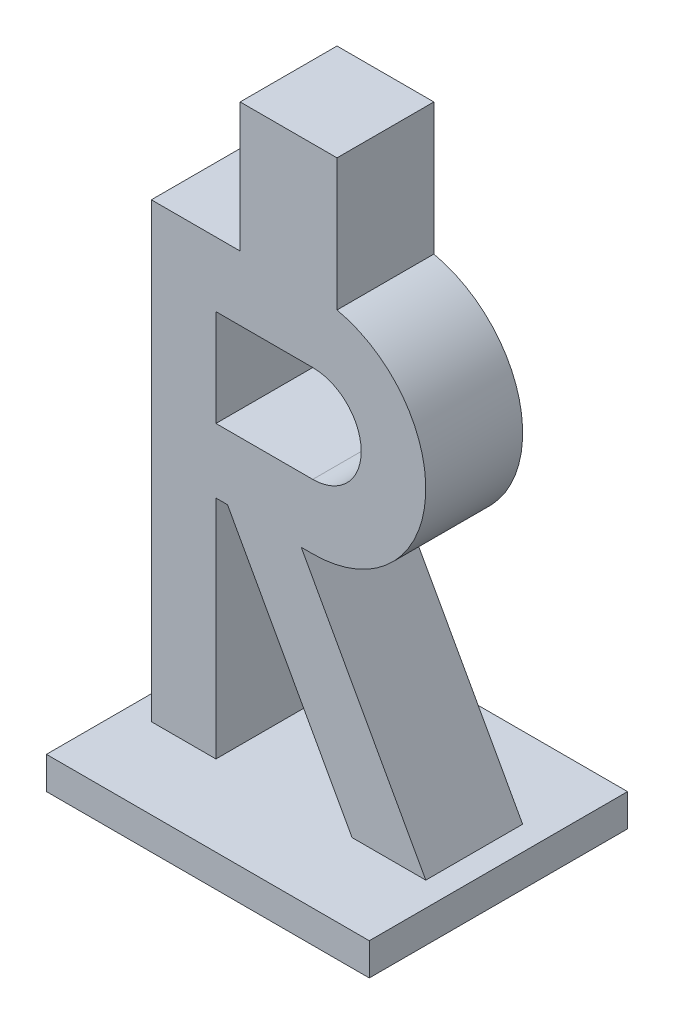
ISO-10303-21;
HEADER;
FILE_DESCRIPTION(('STEP AP214'),'2;1');
FILE_NAME('part.step','',(''),(''),'','','');
FILE_SCHEMA(('AUTOMOTIVE_DESIGN { 1 0 10303 214 1 1 1 1 }'));
ENDSEC;
DATA;
#1=APPLICATION_CONTEXT('core data for automotive mechanical design processes');
#2=APPLICATION_PROTOCOL_DEFINITION('international standard','automotive_design',2000,#1);
#3=PRODUCT_CONTEXT('',#1,'mechanical');
#4=PRODUCT('Part','Part','',(#3));
#5=PRODUCT_RELATED_PRODUCT_CATEGORY('part','',(#4));
#6=PRODUCT_DEFINITION_FORMATION('','',#4);
#7=PRODUCT_DEFINITION_CONTEXT('part definition',#1,'design');
#8=PRODUCT_DEFINITION('design','',#6,#7);
#9=PRODUCT_DEFINITION_SHAPE('','',#8);
#10=(LENGTH_UNIT() NAMED_UNIT(*) SI_UNIT(.MILLI.,.METRE.));
#11=(NAMED_UNIT(*) PLANE_ANGLE_UNIT() SI_UNIT($,.RADIAN.));
#12=(NAMED_UNIT(*) SI_UNIT($,.STERADIAN.) SOLID_ANGLE_UNIT());
#13=UNCERTAINTY_MEASURE_WITH_UNIT(LENGTH_MEASURE(1.E-05),#10,'distance_accuracy_value','');
#14=(GEOMETRIC_REPRESENTATION_CONTEXT(3) GLOBAL_UNCERTAINTY_ASSIGNED_CONTEXT((#13)) GLOBAL_UNIT_ASSIGNED_CONTEXT((#10,
#11,#12)) REPRESENTATION_CONTEXT('',''));
#15=CARTESIAN_POINT('',(0.,0.,0.));
#16=DIRECTION('',(0.,0.,1.));
#17=DIRECTION('',(1.,0.,0.));
#18=AXIS2_PLACEMENT_3D('',#15,#16,#17);
#19=CARTESIAN_POINT('',(25.,52.5,15.));
#20=DIRECTION('',(0.,0.,-1.));
#21=DIRECTION('',(-1.,0.,0.));
#22=AXIS2_PLACEMENT_3D('',#19,#20,#21);
#23=PLANE('',#22);
#24=CARTESIAN_POINT('',(25.,52.5,15.));
#25=DIRECTION('',(0.,0.,1.));
#26=DIRECTION('',(-1.,0.,0.));
#27=AXIS2_PLACEMENT_3D('',#24,#25,#26);
#28=CIRCLE('',#27,17.5);
#29=CARTESIAN_POINT('',(25.,35.,15.));
#30=VERTEX_POINT('',#29);
#31=CARTESIAN_POINT('',(28.75,69.5934929139717,15.));
#32=VERTEX_POINT('',#31);
#33=EDGE_CURVE('E292',#30,#32,#28,.T.);
#34=ORIENTED_EDGE('',*,*,#33,.T.);
#35=DIRECTION('',(0.,1.,0.));
#36=VECTOR('',#35,1.);
#37=CARTESIAN_POINT('',(28.75,69.5934929139717,15.));
#38=LINE('',#37,#36);
#39=CARTESIAN_POINT('',(28.75,90.,15.));
#40=VERTEX_POINT('',#39);
#41=EDGE_CURVE('E209',#32,#40,#38,.T.);
#42=ORIENTED_EDGE('',*,*,#41,.T.);
#43=DIRECTION('',(-1.,0.,0.));
#44=VECTOR('',#43,1.);
#45=CARTESIAN_POINT('',(28.75,90.,15.));
#46=LINE('',#45,#44);
#47=CARTESIAN_POINT('',(13.75,90.,15.));
#48=VERTEX_POINT('',#47);
#49=EDGE_CURVE('E185',#40,#48,#46,.T.);
#50=ORIENTED_EDGE('',*,*,#49,.T.);
#51=DIRECTION('',(0.,-1.,0.));
#52=VECTOR('',#51,1.);
#53=CARTESIAN_POINT('',(13.75,69.5934929139717,15.));
#54=LINE('',#53,#52);
#55=CARTESIAN_POINT('',(13.75,70.,15.));
#56=VERTEX_POINT('',#55);
#57=EDGE_CURVE('E52',#48,#56,#54,.T.);
#58=ORIENTED_EDGE('',*,*,#57,.T.);
#59=DIRECTION('',(-1.,0.,0.));
#60=VECTOR('',#59,1.);
#61=CARTESIAN_POINT('',(0.,70.,15.));
#62=LINE('',#61,#60);
#63=CARTESIAN_POINT('',(0.,70.,15.));
#64=VERTEX_POINT('',#63);
#65=EDGE_CURVE('E295',#56,#64,#62,.T.);
#66=ORIENTED_EDGE('',*,*,#65,.T.);
#67=DIRECTION('',(0.,-1.,0.));
#68=VECTOR('',#67,1.);
#69=CARTESIAN_POINT('',(0.,0.,15.));
#70=LINE('',#69,#68);
#71=CARTESIAN_POINT('',(0.,0.,15.));
#72=VERTEX_POINT('',#71);
#73=EDGE_CURVE('E297',#64,#72,#70,.T.);
#74=ORIENTED_EDGE('',*,*,#73,.T.);
#75=DIRECTION('',(1.,0.,0.));
#76=VECTOR('',#75,1.);
#77=CARTESIAN_POINT('',(10.,0.,15.));
#78=LINE('',#77,#76);
#79=CARTESIAN_POINT('',(10.,0.,15.));
#80=VERTEX_POINT('',#79);
#81=EDGE_CURVE('E274',#72,#80,#78,.T.);
#82=ORIENTED_EDGE('',*,*,#81,.T.);
#83=DIRECTION('',(0.,1.,0.));
#84=VECTOR('',#83,1.);
#85=CARTESIAN_POINT('',(10.,35.,15.));
#86=LINE('',#85,#84);
#87=CARTESIAN_POINT('',(10.,35.,15.));
#88=VERTEX_POINT('',#87);
#89=EDGE_CURVE('E277',#80,#88,#86,.T.);
#90=ORIENTED_EDGE('',*,*,#89,.T.);
#91=DIRECTION('',(1.,0.,0.));
#92=VECTOR('',#91,1.);
#93=CARTESIAN_POINT('',(11.7908306023726,35.,15.));
#94=LINE('',#93,#92);
#95=CARTESIAN_POINT('',(11.7908306023726,35.,15.));
#96=VERTEX_POINT('',#95);
#97=EDGE_CURVE('E280',#88,#96,#94,.T.);
#98=ORIENTED_EDGE('',*,*,#97,.T.);
#99=DIRECTION('',(0.482702955764698,-0.875784138070577,0.));
#100=VECTOR('',#99,1.);
#101=CARTESIAN_POINT('',(31.0816612047453,0.,15.));
#102=LINE('',#101,#100);
#103=CARTESIAN_POINT('',(31.0816612047453,0.,15.));
#104=VERTEX_POINT('',#103);
#105=EDGE_CURVE('E282',#96,#104,#102,.T.);
#106=ORIENTED_EDGE('',*,*,#105,.T.);
#107=DIRECTION('',(1.,0.,0.));
#108=VECTOR('',#107,1.);
#109=CARTESIAN_POINT('',(42.5,0.,15.));
#110=LINE('',#109,#108);
#111=CARTESIAN_POINT('',(42.5,0.,15.));
#112=VERTEX_POINT('',#111);
#113=EDGE_CURVE('E285',#104,#112,#110,.T.);
#114=ORIENTED_EDGE('',*,*,#113,.T.);
#115=DIRECTION('',(-0.482702955764698,0.875784138070577,0.));
#116=VECTOR('',#115,1.);
#117=CARTESIAN_POINT('',(23.2091693976274,35.,15.));
#118=LINE('',#117,#116);
#119=CARTESIAN_POINT('',(23.2091693976274,35.,15.));
#120=VERTEX_POINT('',#119);
#121=EDGE_CURVE('E288',#112,#120,#118,.T.);
#122=ORIENTED_EDGE('',*,*,#121,.T.);
#123=DIRECTION('',(1.,0.,0.));
#124=VECTOR('',#123,1.);
#125=CARTESIAN_POINT('',(25.,35.,15.));
#126=LINE('',#125,#124);
#127=EDGE_CURVE('E290',#120,#30,#126,.T.);
#128=ORIENTED_EDGE('',*,*,#127,.T.);
#129=EDGE_LOOP('',(#34,#42,#50,#58,#66,#74,#82,#90,#98,#106,#114,#122,#128));
#130=FACE_BOUND('',#129,.T.);
#131=CARTESIAN_POINT('',(25.,52.5,15.));
#132=DIRECTION('',(0.,0.,1.));
#133=DIRECTION('',(1.,0.,0.));
#134=AXIS2_PLACEMENT_3D('',#131,#132,#133);
#135=CIRCLE('',#134,7.5);
#136=CARTESIAN_POINT('',(25.,45.,15.));
#137=VERTEX_POINT('',#136);
#138=CARTESIAN_POINT('',(25.,60.,15.));
#139=VERTEX_POINT('',#138);
#140=EDGE_CURVE('E245',#137,#139,#135,.T.);
#141=ORIENTED_EDGE('',*,*,#140,.F.);
#142=DIRECTION('',(1.,0.,0.));
#143=VECTOR('',#142,1.);
#144=CARTESIAN_POINT('',(9.99999999999999,45.,15.));
#145=LINE('',#144,#143);
#146=CARTESIAN_POINT('',(9.99999999999999,45.,15.));
#147=VERTEX_POINT('',#146);
#148=EDGE_CURVE('E252',#147,#137,#145,.T.);
#149=ORIENTED_EDGE('',*,*,#148,.F.);
#150=DIRECTION('',(0.,-1.,0.));
#151=VECTOR('',#150,1.);
#152=CARTESIAN_POINT('',(9.99999999999999,60.,15.));
#153=LINE('',#152,#151);
#154=CARTESIAN_POINT('',(9.99999999999999,60.,15.));
#155=VERTEX_POINT('',#154);
#156=EDGE_CURVE('E250',#155,#147,#153,.T.);
#157=ORIENTED_EDGE('',*,*,#156,.F.);
#158=DIRECTION('',(-1.,0.,0.));
#159=VECTOR('',#158,1.);
#160=CARTESIAN_POINT('',(25.,60.,15.));
#161=LINE('',#160,#159);
#162=EDGE_CURVE('E247',#139,#155,#161,.T.);
#163=ORIENTED_EDGE('',*,*,#162,.F.);
#164=EDGE_LOOP('',(#141,#149,#157,#163));
#165=FACE_BOUND('',#164,.T.);
#166=ADVANCED_FACE('F37',(#130,#165),#23,.F.);
#167=CARTESIAN_POINT('',(25.,52.5,0.));
#168=DIRECTION('',(0.,0.,-1.));
#169=DIRECTION('',(-1.,0.,0.));
#170=AXIS2_PLACEMENT_3D('',#167,#168,#169);
#171=PLANE('',#170);
#172=DIRECTION('',(0.,1.,0.));
#173=VECTOR('',#172,1.);
#174=CARTESIAN_POINT('',(28.75,69.5934929139717,0.));
#175=LINE('',#174,#173);
#176=CARTESIAN_POINT('',(28.75,69.5934929139717,0.));
#177=VERTEX_POINT('',#176);
#178=CARTESIAN_POINT('',(28.75,90.,0.));
#179=VERTEX_POINT('',#178);
#180=EDGE_CURVE('E198',#177,#179,#175,.T.);
#181=ORIENTED_EDGE('',*,*,#180,.F.);
#182=CARTESIAN_POINT('',(25.,52.5,0.));
#183=DIRECTION('',(0.,0.,1.));
#184=DIRECTION('',(-1.,0.,0.));
#185=AXIS2_PLACEMENT_3D('',#182,#183,#184);
#186=CIRCLE('',#185,17.5);
#187=CARTESIAN_POINT('',(25.,35.,0.));
#188=VERTEX_POINT('',#187);
#189=EDGE_CURVE('E315',#188,#177,#186,.T.);
#190=ORIENTED_EDGE('',*,*,#189,.F.);
#191=DIRECTION('',(1.,0.,0.));
#192=VECTOR('',#191,1.);
#193=CARTESIAN_POINT('',(25.,35.,0.));
#194=LINE('',#193,#192);
#195=CARTESIAN_POINT('',(23.2091693976274,35.,0.));
#196=VERTEX_POINT('',#195);
#197=EDGE_CURVE('E313',#196,#188,#194,.T.);
#198=ORIENTED_EDGE('',*,*,#197,.F.);
#199=DIRECTION('',(-0.482702955764698,0.875784138070577,0.));
#200=VECTOR('',#199,1.);
#201=CARTESIAN_POINT('',(23.2091693976274,35.,0.));
#202=LINE('',#201,#200);
#203=CARTESIAN_POINT('',(42.5,0.,0.));
#204=VERTEX_POINT('',#203);
#205=EDGE_CURVE('E311',#204,#196,#202,.T.);
#206=ORIENTED_EDGE('',*,*,#205,.F.);
#207=DIRECTION('',(1.,0.,0.));
#208=VECTOR('',#207,1.);
#209=CARTESIAN_POINT('',(42.5,0.,0.));
#210=LINE('',#209,#208);
#211=CARTESIAN_POINT('',(31.0816612047453,0.,0.));
#212=VERTEX_POINT('',#211);
#213=EDGE_CURVE('E309',#212,#204,#210,.T.);
#214=ORIENTED_EDGE('',*,*,#213,.F.);
#215=DIRECTION('',(0.482702955764698,-0.875784138070577,0.));
#216=VECTOR('',#215,1.);
#217=CARTESIAN_POINT('',(31.0816612047453,0.,0.));
#218=LINE('',#217,#216);
#219=CARTESIAN_POINT('',(11.7908306023726,35.,0.));
#220=VERTEX_POINT('',#219);
#221=EDGE_CURVE('E306',#220,#212,#218,.T.);
#222=ORIENTED_EDGE('',*,*,#221,.F.);
#223=DIRECTION('',(1.,0.,0.));
#224=VECTOR('',#223,1.);
#225=CARTESIAN_POINT('',(11.7908306023726,35.,0.));
#226=LINE('',#225,#224);
#227=CARTESIAN_POINT('',(10.,35.,0.));
#228=VERTEX_POINT('',#227);
#229=EDGE_CURVE('E304',#228,#220,#226,.T.);
#230=ORIENTED_EDGE('',*,*,#229,.F.);
#231=DIRECTION('',(0.,1.,0.));
#232=VECTOR('',#231,1.);
#233=CARTESIAN_POINT('',(10.,35.,0.));
#234=LINE('',#233,#232);
#235=CARTESIAN_POINT('',(10.,0.,0.));
#236=VERTEX_POINT('',#235);
#237=EDGE_CURVE('E302',#236,#228,#234,.T.);
#238=ORIENTED_EDGE('',*,*,#237,.F.);
#239=DIRECTION('',(1.,0.,0.));
#240=VECTOR('',#239,1.);
#241=CARTESIAN_POINT('',(10.,0.,0.));
#242=LINE('',#241,#240);
#243=CARTESIAN_POINT('',(0.,0.,0.));
#244=VERTEX_POINT('',#243);
#245=EDGE_CURVE('E273',#244,#236,#242,.T.);
#246=ORIENTED_EDGE('',*,*,#245,.F.);
#247=DIRECTION('',(0.,-1.,0.));
#248=VECTOR('',#247,1.);
#249=CARTESIAN_POINT('',(0.,0.,0.));
#250=LINE('',#249,#248);
#251=CARTESIAN_POINT('',(0.,70.,0.));
#252=VERTEX_POINT('',#251);
#253=EDGE_CURVE('E278',#252,#244,#250,.T.);
#254=ORIENTED_EDGE('',*,*,#253,.F.);
#255=DIRECTION('',(-1.,0.,0.));
#256=VECTOR('',#255,1.);
#257=CARTESIAN_POINT('',(0.,70.,0.));
#258=LINE('',#257,#256);
#259=CARTESIAN_POINT('',(13.75,70.,0.));
#260=VERTEX_POINT('',#259);
#261=EDGE_CURVE('E317',#260,#252,#258,.T.);
#262=ORIENTED_EDGE('',*,*,#261,.F.);
#263=DIRECTION('',(0.,-1.,0.));
#264=VECTOR('',#263,1.);
#265=CARTESIAN_POINT('',(13.75,69.5934929139717,0.));
#266=LINE('',#265,#264);
#267=CARTESIAN_POINT('',(13.75,90.,0.));
#268=VERTEX_POINT('',#267);
#269=EDGE_CURVE('E190',#268,#260,#266,.T.);
#270=ORIENTED_EDGE('',*,*,#269,.F.);
#271=DIRECTION('',(-1.,0.,0.));
#272=VECTOR('',#271,1.);
#273=CARTESIAN_POINT('',(28.75,90.,0.));
#274=LINE('',#273,#272);
#275=EDGE_CURVE('E184',#179,#268,#274,.T.);
#276=ORIENTED_EDGE('',*,*,#275,.F.);
#277=EDGE_LOOP('',(#181,#190,#198,#206,#214,#222,#230,#238,#246,#254,#262,#270,#276));
#278=FACE_BOUND('',#277,.T.);
#279=DIRECTION('',(1.,0.,0.));
#280=VECTOR('',#279,1.);
#281=CARTESIAN_POINT('',(9.99999999999999,45.,0.));
#282=LINE('',#281,#280);
#283=CARTESIAN_POINT('',(9.99999999999999,45.,0.));
#284=VERTEX_POINT('',#283);
#285=CARTESIAN_POINT('',(25.,45.,0.));
#286=VERTEX_POINT('',#285);
#287=EDGE_CURVE('E248',#284,#286,#282,.T.);
#288=ORIENTED_EDGE('',*,*,#287,.T.);
#289=CARTESIAN_POINT('',(25.,52.5,0.));
#290=DIRECTION('',(0.,0.,1.));
#291=DIRECTION('',(1.,0.,0.));
#292=AXIS2_PLACEMENT_3D('',#289,#290,#291);
#293=CIRCLE('',#292,7.5);
#294=CARTESIAN_POINT('',(25.,60.,0.));
#295=VERTEX_POINT('',#294);
#296=EDGE_CURVE('E244',#286,#295,#293,.T.);
#297=ORIENTED_EDGE('',*,*,#296,.T.);
#298=DIRECTION('',(-1.,0.,0.));
#299=VECTOR('',#298,1.);
#300=CARTESIAN_POINT('',(25.,60.,0.));
#301=LINE('',#300,#299);
#302=CARTESIAN_POINT('',(9.99999999999999,60.,0.));
#303=VERTEX_POINT('',#302);
#304=EDGE_CURVE('E257',#295,#303,#301,.T.);
#305=ORIENTED_EDGE('',*,*,#304,.T.);
#306=DIRECTION('',(0.,-1.,0.));
#307=VECTOR('',#306,1.);
#308=CARTESIAN_POINT('',(9.99999999999999,60.,0.));
#309=LINE('',#308,#307);
#310=EDGE_CURVE('E260',#303,#284,#309,.T.);
#311=ORIENTED_EDGE('',*,*,#310,.T.);
#312=EDGE_LOOP('',(#288,#297,#305,#311));
#313=FACE_BOUND('',#312,.T.);
#314=ADVANCED_FACE('F195',(#278,#313),#171,.T.);
#315=CARTESIAN_POINT('',(10.,35.,15.));
#316=DIRECTION('',(-1.,0.,0.));
#317=DIRECTION('',(0.,-1.,0.));
#318=AXIS2_PLACEMENT_3D('',#315,#316,#317);
#319=PLANE('',#318);
#320=ORIENTED_EDGE('',*,*,#237,.T.);
#321=DIRECTION('',(0.,0.,-1.));
#322=VECTOR('',#321,1.);
#323=CARTESIAN_POINT('',(10.,35.,15.));
#324=LINE('',#323,#322);
#325=EDGE_CURVE('E340',#88,#228,#324,.T.);
#326=ORIENTED_EDGE('',*,*,#325,.F.);
#327=ORIENTED_EDGE('',*,*,#89,.F.);
#328=DIRECTION('',(0.,0.,-1.));
#329=VECTOR('',#328,1.);
#330=CARTESIAN_POINT('',(10.,0.,15.));
#331=LINE('',#330,#329);
#332=EDGE_CURVE('E45',#80,#236,#331,.T.);
#333=ORIENTED_EDGE('',*,*,#332,.T.);
#334=EDGE_LOOP('',(#320,#326,#327,#333));
#335=FACE_BOUND('',#334,.T.);
#336=ADVANCED_FACE('F39',(#335),#319,.F.);
#337=CARTESIAN_POINT('',(11.7908306023726,35.,15.));
#338=DIRECTION('',(0.,1.,0.));
#339=DIRECTION('',(0.,0.,1.));
#340=AXIS2_PLACEMENT_3D('',#337,#338,#339);
#341=PLANE('',#340);
#342=ORIENTED_EDGE('',*,*,#229,.T.);
#343=DIRECTION('',(0.,0.,-1.));
#344=VECTOR('',#343,1.);
#345=CARTESIAN_POINT('',(11.7908306023726,35.,15.));
#346=LINE('',#345,#344);
#347=EDGE_CURVE('E337',#96,#220,#346,.T.);
#348=ORIENTED_EDGE('',*,*,#347,.F.);
#349=ORIENTED_EDGE('',*,*,#97,.F.);
#350=ORIENTED_EDGE('',*,*,#325,.T.);
#351=EDGE_LOOP('',(#342,#348,#349,#350));
#352=FACE_BOUND('',#351,.T.);
#353=ADVANCED_FACE('F385',(#352),#341,.F.);
#354=CARTESIAN_POINT('',(31.0816612047453,0.,15.));
#355=DIRECTION('',(0.875784138070577,0.482702955764698,0.));
#356=DIRECTION('',(-0.482702955764698,0.875784138070577,0.));
#357=AXIS2_PLACEMENT_3D('',#354,#355,#356);
#358=PLANE('',#357);
#359=ORIENTED_EDGE('',*,*,#221,.T.);
#360=DIRECTION('',(0.,0.,-1.));
#361=VECTOR('',#360,1.);
#362=CARTESIAN_POINT('',(31.0816612047453,0.,15.));
#363=LINE('',#362,#361);
#364=EDGE_CURVE('E335',#104,#212,#363,.T.);
#365=ORIENTED_EDGE('',*,*,#364,.F.);
#366=ORIENTED_EDGE('',*,*,#105,.F.);
#367=ORIENTED_EDGE('',*,*,#347,.T.);
#368=EDGE_LOOP('',(#359,#365,#366,#367));
#369=FACE_BOUND('',#368,.T.);
#370=ADVANCED_FACE('F382',(#369),#358,.F.);
#371=CARTESIAN_POINT('',(23.2091693976274,35.,15.));
#372=DIRECTION('',(-0.875784138070577,-0.482702955764698,0.));
#373=DIRECTION('',(0.482702955764698,-0.875784138070577,0.));
#374=AXIS2_PLACEMENT_3D('',#371,#372,#373);
#375=PLANE('',#374);
#376=ORIENTED_EDGE('',*,*,#205,.T.);
#377=DIRECTION('',(0.,0.,-1.));
#378=VECTOR('',#377,1.);
#379=CARTESIAN_POINT('',(23.2091693976274,35.,15.));
#380=LINE('',#379,#378);
#381=EDGE_CURVE('E329',#120,#196,#380,.T.);
#382=ORIENTED_EDGE('',*,*,#381,.F.);
#383=ORIENTED_EDGE('',*,*,#121,.F.);
#384=DIRECTION('',(0.,0.,-1.));
#385=VECTOR('',#384,1.);
#386=CARTESIAN_POINT('',(42.5,0.,15.));
#387=LINE('',#386,#385);
#388=EDGE_CURVE('E332',#112,#204,#387,.T.);
#389=ORIENTED_EDGE('',*,*,#388,.T.);
#390=EDGE_LOOP('',(#376,#382,#383,#389));
#391=FACE_BOUND('',#390,.T.);
#392=ADVANCED_FACE('F376',(#391),#375,.F.);
#393=CARTESIAN_POINT('',(25.,35.,15.));
#394=DIRECTION('',(0.,1.,0.));
#395=DIRECTION('',(0.,0.,1.));
#396=AXIS2_PLACEMENT_3D('',#393,#394,#395);
#397=PLANE('',#396);
#398=ORIENTED_EDGE('',*,*,#197,.T.);
#399=DIRECTION('',(0.,0.,-1.));
#400=VECTOR('',#399,1.);
#401=CARTESIAN_POINT('',(25.,35.,15.));
#402=LINE('',#401,#400);
#403=EDGE_CURVE('E326',#30,#188,#402,.T.);
#404=ORIENTED_EDGE('',*,*,#403,.F.);
#405=ORIENTED_EDGE('',*,*,#127,.F.);
#406=ORIENTED_EDGE('',*,*,#381,.T.);
#407=EDGE_LOOP('',(#398,#404,#405,#406));
#408=FACE_BOUND('',#407,.T.);
#409=ADVANCED_FACE('F371',(#408),#397,.F.);
#410=CARTESIAN_POINT('',(25.,52.5,15.));
#411=DIRECTION('',(0.,0.,-1.));
#412=DIRECTION('',(-1.,0.,0.));
#413=AXIS2_PLACEMENT_3D('',#410,#411,#412);
#414=CYLINDRICAL_SURFACE('',#413,17.5);
#415=ORIENTED_EDGE('',*,*,#189,.T.);
#416=DIRECTION('',(0.,0.,1.));
#417=VECTOR('',#416,1.);
#418=CARTESIAN_POINT('',(28.75,69.5934929139717,0.));
#419=LINE('',#418,#417);
#420=EDGE_CURVE('E204',#177,#32,#419,.T.);
#421=ORIENTED_EDGE('',*,*,#420,.T.);
#422=ORIENTED_EDGE('',*,*,#33,.F.);
#423=ORIENTED_EDGE('',*,*,#403,.T.);
#424=EDGE_LOOP('',(#415,#421,#422,#423));
#425=FACE_BOUND('',#424,.T.);
#426=ADVANCED_FACE('F365',(#425),#414,.T.);
#427=CARTESIAN_POINT('',(0.,70.,15.));
#428=DIRECTION('',(0.,-1.,0.));
#429=DIRECTION('',(1.,0.,0.));
#430=AXIS2_PLACEMENT_3D('',#427,#428,#429);
#431=PLANE('',#430);
#432=ORIENTED_EDGE('',*,*,#65,.F.);
#433=DIRECTION('',(0.,0.,-1.));
#434=VECTOR('',#433,1.);
#435=CARTESIAN_POINT('',(13.75,70.,15.));
#436=LINE('',#435,#434);
#437=EDGE_CURVE('E11',#56,#260,#436,.T.);
#438=ORIENTED_EDGE('',*,*,#437,.T.);
#439=ORIENTED_EDGE('',*,*,#261,.T.);
#440=DIRECTION('',(0.,0.,-1.));
#441=VECTOR('',#440,1.);
#442=CARTESIAN_POINT('',(0.,70.,15.));
#443=LINE('',#442,#441);
#444=EDGE_CURVE('E323',#64,#252,#443,.T.);
#445=ORIENTED_EDGE('',*,*,#444,.F.);
#446=EDGE_LOOP('',(#432,#438,#439,#445));
#447=FACE_BOUND('',#446,.T.);
#448=ADVANCED_FACE('F359',(#447),#431,.F.);
#449=CARTESIAN_POINT('',(0.,0.,15.));
#450=DIRECTION('',(1.,0.,0.));
#451=DIRECTION('',(0.,0.,-1.));
#452=AXIS2_PLACEMENT_3D('',#449,#450,#451);
#453=PLANE('',#452);
#454=ORIENTED_EDGE('',*,*,#253,.T.);
#455=DIRECTION('',(0.,0.,-1.));
#456=VECTOR('',#455,1.);
#457=CARTESIAN_POINT('',(0.,0.,15.));
#458=LINE('',#457,#456);
#459=EDGE_CURVE('E299',#72,#244,#458,.T.);
#460=ORIENTED_EDGE('',*,*,#459,.F.);
#461=ORIENTED_EDGE('',*,*,#73,.F.);
#462=ORIENTED_EDGE('',*,*,#444,.T.);
#463=EDGE_LOOP('',(#454,#460,#461,#462));
#464=FACE_BOUND('',#463,.T.);
#465=ADVANCED_FACE('F354',(#464),#453,.F.);
#466=CARTESIAN_POINT('',(25.,52.5,15.));
#467=DIRECTION('',(0.,0.,-1.));
#468=DIRECTION('',(-1.,0.,0.));
#469=AXIS2_PLACEMENT_3D('',#466,#467,#468);
#470=CYLINDRICAL_SURFACE('',#469,7.5);
#471=ORIENTED_EDGE('',*,*,#296,.F.);
#472=DIRECTION('',(0.,0.,-1.));
#473=VECTOR('',#472,1.);
#474=CARTESIAN_POINT('',(25.,45.,15.));
#475=LINE('',#474,#473);
#476=EDGE_CURVE('E254',#137,#286,#475,.T.);
#477=ORIENTED_EDGE('',*,*,#476,.F.);
#478=ORIENTED_EDGE('',*,*,#140,.T.);
#479=DIRECTION('',(0.,0.,-1.));
#480=VECTOR('',#479,1.);
#481=CARTESIAN_POINT('',(25.,60.,15.));
#482=LINE('',#481,#480);
#483=EDGE_CURVE('E270',#139,#295,#482,.T.);
#484=ORIENTED_EDGE('',*,*,#483,.T.);
#485=EDGE_LOOP('',(#471,#477,#478,#484));
#486=FACE_BOUND('',#485,.T.);
#487=ADVANCED_FACE('F399',(#486),#470,.F.);
#488=CARTESIAN_POINT('',(25.,60.,15.));
#489=DIRECTION('',(0.,-1.,0.));
#490=DIRECTION('',(0.,0.,-1.));
#491=AXIS2_PLACEMENT_3D('',#488,#489,#490);
#492=PLANE('',#491);
#493=ORIENTED_EDGE('',*,*,#304,.F.);
#494=ORIENTED_EDGE('',*,*,#483,.F.);
#495=ORIENTED_EDGE('',*,*,#162,.T.);
#496=DIRECTION('',(0.,0.,-1.));
#497=VECTOR('',#496,1.);
#498=CARTESIAN_POINT('',(9.99999999999999,60.,15.));
#499=LINE('',#498,#497);
#500=EDGE_CURVE('E268',#155,#303,#499,.T.);
#501=ORIENTED_EDGE('',*,*,#500,.T.);
#502=EDGE_LOOP('',(#493,#494,#495,#501));
#503=FACE_BOUND('',#502,.T.);
#504=ADVANCED_FACE('F440',(#503),#492,.T.);
#505=CARTESIAN_POINT('',(9.99999999999999,60.,15.));
#506=DIRECTION('',(1.,0.,0.));
#507=DIRECTION('',(0.,1.,0.));
#508=AXIS2_PLACEMENT_3D('',#505,#506,#507);
#509=PLANE('',#508);
#510=ORIENTED_EDGE('',*,*,#310,.F.);
#511=ORIENTED_EDGE('',*,*,#500,.F.);
#512=ORIENTED_EDGE('',*,*,#156,.T.);
#513=DIRECTION('',(0.,0.,-1.));
#514=VECTOR('',#513,1.);
#515=CARTESIAN_POINT('',(9.99999999999999,45.,15.));
#516=LINE('',#515,#514);
#517=EDGE_CURVE('E60',#147,#284,#516,.T.);
#518=ORIENTED_EDGE('',*,*,#517,.T.);
#519=EDGE_LOOP('',(#510,#511,#512,#518));
#520=FACE_BOUND('',#519,.T.);
#521=ADVANCED_FACE('F447',(#520),#509,.T.);
#522=CARTESIAN_POINT('',(9.99999999999999,45.,15.));
#523=DIRECTION('',(0.,1.,0.));
#524=DIRECTION('',(0.,0.,1.));
#525=AXIS2_PLACEMENT_3D('',#522,#523,#524);
#526=PLANE('',#525);
#527=ORIENTED_EDGE('',*,*,#287,.F.);
#528=ORIENTED_EDGE('',*,*,#517,.F.);
#529=ORIENTED_EDGE('',*,*,#148,.T.);
#530=ORIENTED_EDGE('',*,*,#476,.T.);
#531=EDGE_LOOP('',(#527,#528,#529,#530));
#532=FACE_BOUND('',#531,.T.);
#533=ADVANCED_FACE('F454',(#532),#526,.T.);
#534=CARTESIAN_POINT('',(0.,0.,0.));
#535=DIRECTION('',(0.,-1.,0.));
#536=DIRECTION('',(1.,0.,0.));
#537=AXIS2_PLACEMENT_3D('',#534,#535,#536);
#538=PLANE('',#537);
#539=DIRECTION('',(0.,0.,-1.));
#540=VECTOR('',#539,1.);
#541=CARTESIAN_POINT('',(-3.75,0.,27.5));
#542=LINE('',#541,#540);
#543=CARTESIAN_POINT('',(-3.75,0.,27.5));
#544=VERTEX_POINT('',#543);
#545=CARTESIAN_POINT('',(-3.75,0.,-12.5));
#546=VERTEX_POINT('',#545);
#547=EDGE_CURVE('E213',#544,#546,#542,.T.);
#548=ORIENTED_EDGE('',*,*,#547,.F.);
#549=DIRECTION('',(-1.,0.,0.));
#550=VECTOR('',#549,1.);
#551=CARTESIAN_POINT('',(-3.75,0.,27.5));
#552=LINE('',#551,#550);
#553=CARTESIAN_POINT('',(46.25,0.,27.5));
#554=VERTEX_POINT('',#553);
#555=EDGE_CURVE('E219',#554,#544,#552,.T.);
#556=ORIENTED_EDGE('',*,*,#555,.F.);
#557=DIRECTION('',(0.,0.,1.));
#558=VECTOR('',#557,1.);
#559=CARTESIAN_POINT('',(46.25,0.,27.5));
#560=LINE('',#559,#558);
#561=CARTESIAN_POINT('',(46.25,0.,-12.5));
#562=VERTEX_POINT('',#561);
#563=EDGE_CURVE('E230',#562,#554,#560,.T.);
#564=ORIENTED_EDGE('',*,*,#563,.F.);
#565=DIRECTION('',(1.,0.,0.));
#566=VECTOR('',#565,1.);
#567=CARTESIAN_POINT('',(-3.75,0.,-12.5));
#568=LINE('',#567,#566);
#569=EDGE_CURVE('E228',#546,#562,#568,.T.);
#570=ORIENTED_EDGE('',*,*,#569,.F.);
#571=EDGE_LOOP('',(#548,#556,#564,#570));
#572=FACE_BOUND('',#571,.T.);
#573=ORIENTED_EDGE('',*,*,#245,.T.);
#574=ORIENTED_EDGE('',*,*,#332,.F.);
#575=ORIENTED_EDGE('',*,*,#81,.F.);
#576=ORIENTED_EDGE('',*,*,#459,.T.);
#577=EDGE_LOOP('',(#573,#574,#575,#576));
#578=FACE_BOUND('',#577,.T.);
#579=ORIENTED_EDGE('',*,*,#113,.F.);
#580=ORIENTED_EDGE('',*,*,#364,.T.);
#581=ORIENTED_EDGE('',*,*,#213,.T.);
#582=ORIENTED_EDGE('',*,*,#388,.F.);
#583=EDGE_LOOP('',(#579,#580,#581,#582));
#584=FACE_BOUND('',#583,.T.);
#585=ADVANCED_FACE('F348',(#572,#578,#584),#538,.F.);
#586=CARTESIAN_POINT('',(-3.75,-5.,27.5));
#587=DIRECTION('',(1.,0.,0.));
#588=DIRECTION('',(0.,1.,0.));
#589=AXIS2_PLACEMENT_3D('',#586,#587,#588);
#590=PLANE('',#589);
#591=ORIENTED_EDGE('',*,*,#547,.T.);
#592=DIRECTION('',(0.,1.,0.));
#593=VECTOR('',#592,1.);
#594=CARTESIAN_POINT('',(-3.75,-5.,-12.5));
#595=LINE('',#594,#593);
#596=CARTESIAN_POINT('',(-3.75,-5.,-12.5));
#597=VERTEX_POINT('',#596);
#598=EDGE_CURVE('E241',#597,#546,#595,.T.);
#599=ORIENTED_EDGE('',*,*,#598,.F.);
#600=DIRECTION('',(0.,0.,-1.));
#601=VECTOR('',#600,1.);
#602=CARTESIAN_POINT('',(-3.75,-5.,27.5));
#603=LINE('',#602,#601);
#604=CARTESIAN_POINT('',(-3.75,-5.,27.5));
#605=VERTEX_POINT('',#604);
#606=EDGE_CURVE('E215',#605,#597,#603,.T.);
#607=ORIENTED_EDGE('',*,*,#606,.F.);
#608=DIRECTION('',(0.,1.,0.));
#609=VECTOR('',#608,1.);
#610=CARTESIAN_POINT('',(-3.75,-5.,27.5));
#611=LINE('',#610,#609);
#612=EDGE_CURVE('E225',#605,#544,#611,.T.);
#613=ORIENTED_EDGE('',*,*,#612,.T.);
#614=EDGE_LOOP('',(#591,#599,#607,#613));
#615=FACE_BOUND('',#614,.T.);
#616=ADVANCED_FACE('F468',(#615),#590,.F.);
#617=CARTESIAN_POINT('',(-3.75,-5.,-12.5));
#618=DIRECTION('',(0.,0.,1.));
#619=DIRECTION('',(1.,0.,0.));
#620=AXIS2_PLACEMENT_3D('',#617,#618,#619);
#621=PLANE('',#620);
#622=ORIENTED_EDGE('',*,*,#569,.T.);
#623=DIRECTION('',(0.,1.,0.));
#624=VECTOR('',#623,1.);
#625=CARTESIAN_POINT('',(46.25,-5.,-12.5));
#626=LINE('',#625,#624);
#627=CARTESIAN_POINT('',(46.25,-5.,-12.5));
#628=VERTEX_POINT('',#627);
#629=EDGE_CURVE('E238',#628,#562,#626,.T.);
#630=ORIENTED_EDGE('',*,*,#629,.F.);
#631=DIRECTION('',(1.,0.,0.));
#632=VECTOR('',#631,1.);
#633=CARTESIAN_POINT('',(-3.75,-5.,-12.5));
#634=LINE('',#633,#632);
#635=EDGE_CURVE('E218',#597,#628,#634,.T.);
#636=ORIENTED_EDGE('',*,*,#635,.F.);
#637=ORIENTED_EDGE('',*,*,#598,.T.);
#638=EDGE_LOOP('',(#622,#630,#636,#637));
#639=FACE_BOUND('',#638,.T.);
#640=ADVANCED_FACE('F476',(#639),#621,.F.);
#641=CARTESIAN_POINT('',(46.25,-5.,27.5));
#642=DIRECTION('',(-1.,0.,0.));
#643=DIRECTION('',(0.,0.,1.));
#644=AXIS2_PLACEMENT_3D('',#641,#642,#643);
#645=PLANE('',#644);
#646=ORIENTED_EDGE('',*,*,#563,.T.);
#647=DIRECTION('',(0.,1.,0.));
#648=VECTOR('',#647,1.);
#649=CARTESIAN_POINT('',(46.25,-5.,27.5));
#650=LINE('',#649,#648);
#651=CARTESIAN_POINT('',(46.25,-5.,27.5));
#652=VERTEX_POINT('',#651);
#653=EDGE_CURVE('E235',#652,#554,#650,.T.);
#654=ORIENTED_EDGE('',*,*,#653,.F.);
#655=DIRECTION('',(0.,0.,1.));
#656=VECTOR('',#655,1.);
#657=CARTESIAN_POINT('',(46.25,-5.,27.5));
#658=LINE('',#657,#656);
#659=EDGE_CURVE('E221',#628,#652,#658,.T.);
#660=ORIENTED_EDGE('',*,*,#659,.F.);
#661=ORIENTED_EDGE('',*,*,#629,.T.);
#662=EDGE_LOOP('',(#646,#654,#660,#661));
#663=FACE_BOUND('',#662,.T.);
#664=ADVANCED_FACE('F484',(#663),#645,.F.);
#665=CARTESIAN_POINT('',(-3.75,-5.,27.5));
#666=DIRECTION('',(0.,0.,-1.));
#667=DIRECTION('',(-1.,0.,0.));
#668=AXIS2_PLACEMENT_3D('',#665,#666,#667);
#669=PLANE('',#668);
#670=ORIENTED_EDGE('',*,*,#555,.T.);
#671=ORIENTED_EDGE('',*,*,#612,.F.);
#672=DIRECTION('',(-1.,0.,0.));
#673=VECTOR('',#672,1.);
#674=CARTESIAN_POINT('',(-3.75,-5.,27.5));
#675=LINE('',#674,#673);
#676=EDGE_CURVE('E223',#652,#605,#675,.T.);
#677=ORIENTED_EDGE('',*,*,#676,.F.);
#678=ORIENTED_EDGE('',*,*,#653,.T.);
#679=EDGE_LOOP('',(#670,#671,#677,#678));
#680=FACE_BOUND('',#679,.T.);
#681=ADVANCED_FACE('F492',(#680),#669,.F.);
#682=CARTESIAN_POINT('',(0.,-5.,0.));
#683=DIRECTION('',(0.,-1.,0.));
#684=DIRECTION('',(1.,0.,0.));
#685=AXIS2_PLACEMENT_3D('',#682,#683,#684);
#686=PLANE('',#685);
#687=ORIENTED_EDGE('',*,*,#606,.T.);
#688=ORIENTED_EDGE('',*,*,#635,.T.);
#689=ORIENTED_EDGE('',*,*,#659,.T.);
#690=ORIENTED_EDGE('',*,*,#676,.T.);
#691=EDGE_LOOP('',(#687,#688,#689,#690));
#692=FACE_BOUND('',#691,.T.);
#693=ADVANCED_FACE('F500',(#692),#686,.T.);
#694=CARTESIAN_POINT('',(13.75,69.5934929139717,0.));
#695=DIRECTION('',(-1.,0.,0.));
#696=DIRECTION('',(0.,0.,1.));
#697=AXIS2_PLACEMENT_3D('',#694,#695,#696);
#698=PLANE('',#697);
#699=ORIENTED_EDGE('',*,*,#437,.F.);
#700=ORIENTED_EDGE('',*,*,#57,.F.);
#701=DIRECTION('',(0.,0.,1.));
#702=VECTOR('',#701,1.);
#703=CARTESIAN_POINT('',(13.75,90.,0.));
#704=LINE('',#703,#702);
#705=EDGE_CURVE('E189',#268,#48,#704,.T.);
#706=ORIENTED_EDGE('',*,*,#705,.F.);
#707=ORIENTED_EDGE('',*,*,#269,.T.);
#708=EDGE_LOOP('',(#699,#700,#706,#707));
#709=FACE_BOUND('',#708,.T.);
#710=ADVANCED_FACE('F361',(#709),#698,.T.);
#711=CARTESIAN_POINT('',(28.75,69.5934929139717,0.));
#712=DIRECTION('',(1.,0.,0.));
#713=DIRECTION('',(0.,0.,-1.));
#714=AXIS2_PLACEMENT_3D('',#711,#712,#713);
#715=PLANE('',#714);
#716=ORIENTED_EDGE('',*,*,#41,.F.);
#717=ORIENTED_EDGE('',*,*,#420,.F.);
#718=ORIENTED_EDGE('',*,*,#180,.T.);
#719=DIRECTION('',(0.,0.,1.));
#720=VECTOR('',#719,1.);
#721=CARTESIAN_POINT('',(28.75,90.,0.));
#722=LINE('',#721,#720);
#723=EDGE_CURVE('E181',#179,#40,#722,.T.);
#724=ORIENTED_EDGE('',*,*,#723,.T.);
#725=EDGE_LOOP('',(#716,#717,#718,#724));
#726=FACE_BOUND('',#725,.T.);
#727=ADVANCED_FACE('F202',(#726),#715,.T.);
#728=CARTESIAN_POINT('',(28.75,90.,0.));
#729=DIRECTION('',(0.,1.,0.));
#730=DIRECTION('',(0.,0.,1.));
#731=AXIS2_PLACEMENT_3D('',#728,#729,#730);
#732=PLANE('',#731);
#733=ORIENTED_EDGE('',*,*,#49,.F.);
#734=ORIENTED_EDGE('',*,*,#723,.F.);
#735=ORIENTED_EDGE('',*,*,#275,.T.);
#736=ORIENTED_EDGE('',*,*,#705,.T.);
#737=EDGE_LOOP('',(#733,#734,#735,#736));
#738=FACE_BOUND('',#737,.T.);
#739=ADVANCED_FACE('F183',(#738),#732,.T.);
#740=CLOSED_SHELL('',(#166,#314,#336,#353,#370,#392,#409,#426,#448,#465,#487,#504,#521,#533,
#585,#616,#640,#664,#681,#693,#710,#727,#739));
#741=MANIFOLD_SOLID_BREP('B2',#740);
#742=ADVANCED_BREP_SHAPE_REPRESENTATION('',(#18,#741),#14);
#743=SHAPE_DEFINITION_REPRESENTATION(#9,#742);
ENDSEC;
END-ISO-10303-21;
